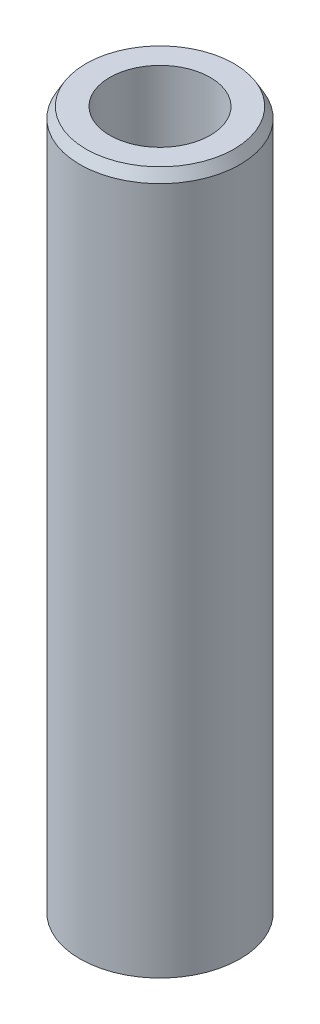
ISO-10303-21;
HEADER;
FILE_DESCRIPTION(('STEP AP214'),'2;1');
FILE_NAME('part.step','',(''),(''),'','','');
FILE_SCHEMA(('AUTOMOTIVE_DESIGN { 1 0 10303 214 1 1 1 1 }'));
ENDSEC;
DATA;
#1=APPLICATION_CONTEXT('core data for automotive mechanical design processes');
#2=APPLICATION_PROTOCOL_DEFINITION('international standard','automotive_design',2000,#1);
#3=PRODUCT_CONTEXT('',#1,'mechanical');
#4=PRODUCT('Part','Part','',(#3));
#5=PRODUCT_RELATED_PRODUCT_CATEGORY('part','',(#4));
#6=PRODUCT_DEFINITION_FORMATION('','',#4);
#7=PRODUCT_DEFINITION_CONTEXT('part definition',#1,'design');
#8=PRODUCT_DEFINITION('design','',#6,#7);
#9=PRODUCT_DEFINITION_SHAPE('','',#8);
#10=(LENGTH_UNIT() NAMED_UNIT(*) SI_UNIT(.MILLI.,.METRE.));
#11=(NAMED_UNIT(*) PLANE_ANGLE_UNIT() SI_UNIT($,.RADIAN.));
#12=(NAMED_UNIT(*) SI_UNIT($,.STERADIAN.) SOLID_ANGLE_UNIT());
#13=UNCERTAINTY_MEASURE_WITH_UNIT(LENGTH_MEASURE(1.E-05),#10,'distance_accuracy_value','');
#14=(GEOMETRIC_REPRESENTATION_CONTEXT(3) GLOBAL_UNCERTAINTY_ASSIGNED_CONTEXT((#13)) GLOBAL_UNIT_ASSIGNED_CONTEXT((#10,
#11,#12)) REPRESENTATION_CONTEXT('',''));
#15=CARTESIAN_POINT('',(0.,0.,0.));
#16=DIRECTION('',(0.,0.,1.));
#17=DIRECTION('',(1.,0.,0.));
#18=AXIS2_PLACEMENT_3D('',#15,#16,#17);
#19=CARTESIAN_POINT('',(0.,65.9908509891248,0.));
#20=DIRECTION('',(0.,-1.,0.));
#21=DIRECTION('',(0.,0.,-1.));
#22=AXIS2_PLACEMENT_3D('',#19,#20,#21);
#23=CYLINDRICAL_SURFACE('',#22,7.5);
#24=CARTESIAN_POINT('',(0.,65.0168997449769,0.));
#25=DIRECTION('',(0.,1.,0.));
#26=DIRECTION('',(0.,0.,1.));
#27=AXIS2_PLACEMENT_3D('',#24,#25,#26);
#28=CIRCLE('',#27,7.5);
#29=CARTESIAN_POINT('',(0.,65.0168997449768,-7.5));
#30=VERTEX_POINT('',#29);
#31=EDGE_CURVE('E50',#30,#30,#28,.F.);
#32=CARTESIAN_POINT('',(0.,0.562311012986413,0.));
#33=DIRECTION('',(0.,1.,0.));
#34=DIRECTION('',(0.,0.,1.));
#35=AXIS2_PLACEMENT_3D('',#32,#33,#34);
#36=CIRCLE('',#35,7.5);
#37=CARTESIAN_POINT('',(0.,0.562311012986413,-7.5));
#38=VERTEX_POINT('',#37);
#39=EDGE_CURVE('E51',#38,#38,#36,.T.);
#40=CARTESIAN_POINT('',(0.,65.0168997449768,-7.5));
#41=CARTESIAN_POINT('',(0.,64.3454977790186,-7.5));
#42=CARTESIAN_POINT('',(0.,63.6740958130604,-7.5));
#43=CARTESIAN_POINT('',(0.,62.3312918811439,-7.5));
#44=CARTESIAN_POINT('',(0.,61.6598899151857,-7.5));
#45=CARTESIAN_POINT('',(0.,60.3170859832692,-7.5));
#46=CARTESIAN_POINT('',(0.,59.645684017311,-7.5));
#47=CARTESIAN_POINT('',(0.,58.3028800853945,-7.5));
#48=CARTESIAN_POINT('',(0.,57.6314781194363,-7.5));
#49=CARTESIAN_POINT('',(0.,56.2886741875198,-7.5));
#50=CARTESIAN_POINT('',(0.,55.6172722215616,-7.5));
#51=CARTESIAN_POINT('',(0.,54.2744682896451,-7.5));
#52=CARTESIAN_POINT('',(0.,53.6030663236869,-7.5));
#53=CARTESIAN_POINT('',(0.,52.2602623917704,-7.5));
#54=CARTESIAN_POINT('',(0.,51.5888604258122,-7.5));
#55=CARTESIAN_POINT('',(0.,50.2460564938957,-7.5));
#56=CARTESIAN_POINT('',(0.,49.5746545279375,-7.5));
#57=CARTESIAN_POINT('',(0.,48.231850596021,-7.5));
#58=CARTESIAN_POINT('',(0.,47.5604486300628,-7.5));
#59=CARTESIAN_POINT('',(0.,46.2176446981463,-7.5));
#60=CARTESIAN_POINT('',(0.,45.5462427321881,-7.5));
#61=CARTESIAN_POINT('',(0.,44.2034388002716,-7.5));
#62=CARTESIAN_POINT('',(0.,43.5320368343134,-7.5));
#63=CARTESIAN_POINT('',(0.,42.1892329023969,-7.5));
#64=CARTESIAN_POINT('',(0.,41.5178309364387,-7.5));
#65=CARTESIAN_POINT('',(0.,40.1750270045222,-7.5));
#66=CARTESIAN_POINT('',(0.,39.503625038564,-7.5));
#67=CARTESIAN_POINT('',(0.,38.1608211066475,-7.5));
#68=CARTESIAN_POINT('',(0.,37.4894191406893,-7.5));
#69=CARTESIAN_POINT('',(0.,36.1466152087728,-7.5));
#70=CARTESIAN_POINT('',(0.,35.4752132428146,-7.5));
#71=CARTESIAN_POINT('',(0.,34.1324093108981,-7.5));
#72=CARTESIAN_POINT('',(0.,33.4610073449399,-7.5));
#73=CARTESIAN_POINT('',(0.,32.1182034130234,-7.5));
#74=CARTESIAN_POINT('',(0.,31.4468014470652,-7.5));
#75=CARTESIAN_POINT('',(0.,30.1039975151487,-7.5));
#76=CARTESIAN_POINT('',(0.,29.4325955491905,-7.5));
#77=CARTESIAN_POINT('',(0.,28.089791617274,-7.5));
#78=CARTESIAN_POINT('',(0.,27.4183896513158,-7.5));
#79=CARTESIAN_POINT('',(0.,26.0755857193993,-7.5));
#80=CARTESIAN_POINT('',(0.,25.4041837534411,-7.5));
#81=CARTESIAN_POINT('',(0.,24.0613798215246,-7.5));
#82=CARTESIAN_POINT('',(0.,23.3899778555664,-7.5));
#83=CARTESIAN_POINT('',(0.,22.0471739236499,-7.5));
#84=CARTESIAN_POINT('',(0.,21.3757719576917,-7.5));
#85=CARTESIAN_POINT('',(0.,20.0329680257752,-7.5));
#86=CARTESIAN_POINT('',(0.,19.361566059817,-7.5));
#87=CARTESIAN_POINT('',(0.,18.0187621279005,-7.5));
#88=CARTESIAN_POINT('',(0.,17.3473601619423,-7.5));
#89=CARTESIAN_POINT('',(0.,16.0045562300258,-7.5));
#90=CARTESIAN_POINT('',(0.,15.3331542640676,-7.5));
#91=CARTESIAN_POINT('',(0.,13.9903503321511,-7.5));
#92=CARTESIAN_POINT('',(0.,13.3189483661929,-7.5));
#93=CARTESIAN_POINT('',(0.,11.9761444342764,-7.5));
#94=CARTESIAN_POINT('',(0.,11.3047424683181,-7.5));
#95=CARTESIAN_POINT('',(0.,9.96193853640168,-7.5));
#96=CARTESIAN_POINT('',(0.,9.29053657044345,-7.5));
#97=CARTESIAN_POINT('',(0.,7.94773263852699,-7.5));
#98=CARTESIAN_POINT('',(0.,7.27633067256875,-7.5));
#99=CARTESIAN_POINT('',(0.,5.93352674065228,-7.5));
#100=CARTESIAN_POINT('',(0.,5.26212477469405,-7.5));
#101=CARTESIAN_POINT('',(0.,3.91932084277758,-7.5));
#102=CARTESIAN_POINT('',(0.,3.24791887681935,-7.5));
#103=CARTESIAN_POINT('',(0.,1.90511494490289,-7.5));
#104=CARTESIAN_POINT('',(0.,1.23371297894465,-7.5));
#105=CARTESIAN_POINT('',(0.,0.562311012986413,-7.5));
#106=B_SPLINE_CURVE_WITH_KNOTS('',3,(#40,#41,#42,#43,#44,#45,#46,#47,#48,#49,#50,#51,#52,#53,
#54,#55,#56,#57,#58,#59,#60,#61,#62,#63,#64,#65,#66,#67,#68,#69,#70,#71,#72,#73,#74,#75,#76,#77,
#78,#79,#80,#81,#82,#83,#84,#85,#86,#87,#88,#89,#90,#91,#92,#93,#94,#95,#96,#97,#98,#99,#100,
#101,#102,#103,#104,#105),.UNSPECIFIED.,.F.,.F.,(4,2,2,2,2,2,2,2,2,2,2,2,2,2,2,2,2,2,2,2,2,2,2,
2,2,2,2,2,2,2,2,2,4),(0.,2.0142058978747,4.02841179574939,6.0426176936241,8.0568235914988,
10.0710294893735,12.0852353872482,14.0994412851229,16.1136471829976,18.1278530808723,
20.142058978747,22.1562648766217,24.1704707744964,26.1846766723711,28.1988825702458,
30.2130884681205,32.2272943659952,34.2415002638699,36.2557061617446,38.2699120596193,
40.284117957494,42.2983238553687,44.3125297532434,46.3267356511181,48.3409415489928,
50.3551474468675,52.3693533447422,54.3835592426169,56.3977651404916,58.4119710383663,
60.426176936241,62.4403828341157,64.4545887319904),.UNSPECIFIED.);
#107=EDGE_CURVE('BSEAM39',#30,#38,#106,.T.);
#108=ORIENTED_EDGE('',*,*,#31,.T.);
#109=ORIENTED_EDGE('',*,*,#39,.T.);
#110=ORIENTED_EDGE('',*,*,#107,.T.);
#111=ORIENTED_EDGE('',*,*,#107,.F.);
#112=EDGE_LOOP('',(#108,#110,#109,#111));
#113=FACE_BOUND('',#112,.T.);
#114=ADVANCED_FACE('F39',(#113),#23,.T.);
#115=CARTESIAN_POINT('',(0.,65.9908509891248,0.));
#116=DIRECTION('',(0.,1.,0.));
#117=DIRECTION('',(0.,0.,1.));
#118=AXIS2_PLACEMENT_3D('',#115,#116,#117);
#119=PLANE('',#118);
#120=CARTESIAN_POINT('',(0.,65.9908509891248,0.));
#121=DIRECTION('',(0.,1.,0.));
#122=DIRECTION('',(0.,0.,1.));
#123=AXIS2_PLACEMENT_3D('',#120,#121,#122);
#124=CIRCLE('',#123,6.93768898701364);
#125=CARTESIAN_POINT('',(0.,65.9908509891248,6.93768898701364));
#126=VERTEX_POINT('',#125);
#127=EDGE_CURVE('E54',#126,#126,#124,.T.);
#128=ORIENTED_EDGE('',*,*,#127,.T.);
#129=EDGE_LOOP('',(#128));
#130=FACE_BOUND('',#129,.T.);
#131=CARTESIAN_POINT('',(0.,65.9908509891248,0.));
#132=DIRECTION('',(0.,1.,0.));
#133=DIRECTION('',(0.,0.,1.));
#134=AXIS2_PLACEMENT_3D('',#131,#132,#133);
#135=CIRCLE('',#134,4.7059466608016);
#136=CARTESIAN_POINT('',(0.,65.9908509891248,-4.7059466608016));
#137=VERTEX_POINT('',#136);
#138=EDGE_CURVE('E58',#137,#137,#135,.T.);
#139=ORIENTED_EDGE('',*,*,#138,.F.);
#140=EDGE_LOOP('',(#139));
#141=FACE_BOUND('',#140,.T.);
#142=ADVANCED_FACE('F69',(#130,#141),#119,.T.);
#143=CARTESIAN_POINT('',(0.,0.,0.));
#144=DIRECTION('',(0.,1.,0.));
#145=DIRECTION('',(0.,0.,1.));
#146=AXIS2_PLACEMENT_3D('',#143,#144,#145);
#147=PLANE('',#146);
#148=CARTESIAN_POINT('',(0.,0.,0.));
#149=DIRECTION('',(0.,1.,0.));
#150=DIRECTION('',(0.,0.,1.));
#151=AXIS2_PLACEMENT_3D('',#148,#149,#150);
#152=CIRCLE('',#151,6.526048755852);
#153=CARTESIAN_POINT('',(0.,0.,6.526048755852));
#154=VERTEX_POINT('',#153);
#155=EDGE_CURVE('E10',#154,#154,#152,.F.);
#156=ORIENTED_EDGE('',*,*,#155,.T.);
#157=EDGE_LOOP('',(#156));
#158=FACE_BOUND('',#157,.T.);
#159=CARTESIAN_POINT('',(0.,0.,0.));
#160=DIRECTION('',(0.,1.,0.));
#161=DIRECTION('',(0.,0.,1.));
#162=AXIS2_PLACEMENT_3D('',#159,#160,#161);
#163=CIRCLE('',#162,4.7059466608016);
#164=CARTESIAN_POINT('',(0.,0.,-4.7059466608016));
#165=VERTEX_POINT('',#164);
#166=EDGE_CURVE('E63',#165,#165,#163,.T.);
#167=ORIENTED_EDGE('',*,*,#166,.T.);
#168=EDGE_LOOP('',(#167));
#169=FACE_BOUND('',#168,.T.);
#170=ADVANCED_FACE('F75',(#158,#169),#147,.F.);
#171=CARTESIAN_POINT('',(0.,65.9908509891248,0.));
#172=DIRECTION('',(0.,-1.,0.));
#173=DIRECTION('',(0.,0.,-1.));
#174=AXIS2_PLACEMENT_3D('',#171,#172,#173);
#175=CYLINDRICAL_SURFACE('',#174,4.7059466608016);
#176=CARTESIAN_POINT('',(0.,65.9908509891248,-4.7059466608016));
#177=CARTESIAN_POINT('',(0.,65.3034462913214,-4.7059466608016));
#178=CARTESIAN_POINT('',(0.,64.616041593518,-4.7059466608016));
#179=CARTESIAN_POINT('',(0.,63.2412321979112,-4.7059466608016));
#180=CARTESIAN_POINT('',(0.,62.5538275001079,-4.7059466608016));
#181=CARTESIAN_POINT('',(0.,61.1790181045011,-4.7059466608016));
#182=CARTESIAN_POINT('',(0.,60.4916134066977,-4.7059466608016));
#183=CARTESIAN_POINT('',(0.,59.1168040110909,-4.7059466608016));
#184=CARTESIAN_POINT('',(0.,58.4293993132875,-4.7059466608016));
#185=CARTESIAN_POINT('',(0.,57.0545899176808,-4.7059466608016));
#186=CARTESIAN_POINT('',(0.,56.3671852198774,-4.7059466608016));
#187=CARTESIAN_POINT('',(0.,54.9923758242706,-4.7059466608016));
#188=CARTESIAN_POINT('',(0.,54.3049711264673,-4.7059466608016));
#189=CARTESIAN_POINT('',(0.,52.9301617308605,-4.7059466608016));
#190=CARTESIAN_POINT('',(0.,52.2427570330571,-4.7059466608016));
#191=CARTESIAN_POINT('',(0.,50.8679476374503,-4.7059466608016));
#192=CARTESIAN_POINT('',(0.,50.180542939647,-4.7059466608016));
#193=CARTESIAN_POINT('',(0.,48.8057335440402,-4.7059466608016));
#194=CARTESIAN_POINT('',(0.,48.1183288462368,-4.7059466608016));
#195=CARTESIAN_POINT('',(0.,46.74351945063,-4.7059466608016));
#196=CARTESIAN_POINT('',(0.,46.0561147528267,-4.7059466608016));
#197=CARTESIAN_POINT('',(0.,44.6813053572199,-4.7059466608016));
#198=CARTESIAN_POINT('',(0.,43.9939006594165,-4.7059466608016));
#199=CARTESIAN_POINT('',(0.,42.6190912638097,-4.7059466608016));
#200=CARTESIAN_POINT('',(0.,41.9316865660064,-4.7059466608016));
#201=CARTESIAN_POINT('',(0.,40.5568771703996,-4.7059466608016));
#202=CARTESIAN_POINT('',(0.,39.8694724725962,-4.7059466608016));
#203=CARTESIAN_POINT('',(0.,38.4946630769894,-4.7059466608016));
#204=CARTESIAN_POINT('',(0.,37.8072583791861,-4.7059466608016));
#205=CARTESIAN_POINT('',(0.,36.4324489835793,-4.7059466608016));
#206=CARTESIAN_POINT('',(0.,35.7450442857759,-4.7059466608016));
#207=CARTESIAN_POINT('',(0.,34.3702348901691,-4.7059466608016));
#208=CARTESIAN_POINT('',(0.,33.6828301923658,-4.7059466608016));
#209=CARTESIAN_POINT('',(0.,32.308020796759,-4.7059466608016));
#210=CARTESIAN_POINT('',(0.,31.6206160989556,-4.7059466608016));
#211=CARTESIAN_POINT('',(0.,30.2458067033488,-4.7059466608016));
#212=CARTESIAN_POINT('',(0.,29.5584020055455,-4.7059466608016));
#213=CARTESIAN_POINT('',(0.,28.1835926099387,-4.7059466608016));
#214=CARTESIAN_POINT('',(0.,27.4961879121353,-4.7059466608016));
#215=CARTESIAN_POINT('',(0.,26.1213785165285,-4.7059466608016));
#216=CARTESIAN_POINT('',(0.,25.4339738187252,-4.7059466608016));
#217=CARTESIAN_POINT('',(0.,24.0591644231184,-4.7059466608016));
#218=CARTESIAN_POINT('',(0.,23.371759725315,-4.7059466608016));
#219=CARTESIAN_POINT('',(0.,21.9969503297082,-4.7059466608016));
#220=CARTESIAN_POINT('',(0.,21.3095456319049,-4.7059466608016));
#221=CARTESIAN_POINT('',(0.,19.9347362362981,-4.7059466608016));
#222=CARTESIAN_POINT('',(0.,19.2473315384947,-4.7059466608016));
#223=CARTESIAN_POINT('',(0.,17.8725221428879,-4.7059466608016));
#224=CARTESIAN_POINT('',(0.,17.1851174450846,-4.7059466608016));
#225=CARTESIAN_POINT('',(0.,15.8103080494778,-4.7059466608016));
#226=CARTESIAN_POINT('',(0.,15.1229033516744,-4.7059466608016));
#227=CARTESIAN_POINT('',(0.,13.7480939560676,-4.7059466608016));
#228=CARTESIAN_POINT('',(0.,13.0606892582643,-4.7059466608016));
#229=CARTESIAN_POINT('',(0.,11.6858798626575,-4.7059466608016));
#230=CARTESIAN_POINT('',(0.,10.9984751648541,-4.7059466608016));
#231=CARTESIAN_POINT('',(0.,9.62366576924735,-4.7059466608016));
#232=CARTESIAN_POINT('',(0.,8.93626107144397,-4.7059466608016));
#233=CARTESIAN_POINT('',(0.,7.5614516758372,-4.7059466608016));
#234=CARTESIAN_POINT('',(0.,6.87404697803382,-4.7059466608016));
#235=CARTESIAN_POINT('',(0.,5.49923758242705,-4.7059466608016));
#236=CARTESIAN_POINT('',(0.,4.81183288462367,-4.7059466608016));
#237=CARTESIAN_POINT('',(0.,3.4370234890169,-4.7059466608016));
#238=CARTESIAN_POINT('',(0.,2.74961879121352,-4.7059466608016));
#239=CARTESIAN_POINT('',(0.,1.37480939560675,-4.7059466608016));
#240=CARTESIAN_POINT('',(0.,0.687404697803367,-4.7059466608016));
#241=CARTESIAN_POINT('',(0.,0.,-4.7059466608016));
#242=B_SPLINE_CURVE_WITH_KNOTS('',3,(#176,#177,#178,#179,#180,#181,#182,#183,#184,#185,#186,
#187,#188,#189,#190,#191,#192,#193,#194,#195,#196,#197,#198,#199,#200,#201,#202,#203,#204,#205,
#206,#207,#208,#209,#210,#211,#212,#213,#214,#215,#216,#217,#218,#219,#220,#221,#222,#223,#224,
#225,#226,#227,#228,#229,#230,#231,#232,#233,#234,#235,#236,#237,#238,#239,#240,#241),
.UNSPECIFIED.,.F.,.F.,(4,2,2,2,2,2,2,2,2,2,2,2,2,2,2,2,2,2,2,2,2,2,2,2,2,2,2,2,2,2,2,2,4),(0.,
2.06221409341015,4.12442818682029,6.18664228023044,8.24885637364059,10.3110704670507,
12.3732845604609,14.435498653871,16.4977127472812,18.5599268406913,20.6221409341015,
22.6843550275116,24.7465691209218,26.8087832143319,28.8709973077421,30.9332114011522,
32.9954254945624,35.0576395879725,37.1198536813827,39.1820677747928,41.244281868203,
43.3064959616131,45.3687100550233,47.4309241484334,49.4931382418436,51.5553523352537,
53.6175664286639,55.679780522074,57.7419946154842,59.8042087088943,61.8664228023045,
63.9286368957146,65.9908509891248),.UNSPECIFIED.);
#243=EDGE_CURVE('BSEAM70',#137,#165,#242,.T.);
#244=ORIENTED_EDGE('',*,*,#138,.T.);
#245=ORIENTED_EDGE('',*,*,#166,.F.);
#246=ORIENTED_EDGE('',*,*,#243,.T.);
#247=ORIENTED_EDGE('',*,*,#243,.F.);
#248=EDGE_LOOP('',(#244,#246,#245,#247));
#249=FACE_BOUND('',#248,.T.);
#250=ADVANCED_FACE('F70',(#249),#175,.F.);
#251=CARTESIAN_POINT('',(0.,65.9908509891248,0.));
#252=DIRECTION('',(0.,-1.,0.));
#253=DIRECTION('',(0.,0.,-1.));
#254=AXIS2_PLACEMENT_3D('',#251,#252,#253);
#255=CONICAL_SURFACE('',#254,6.93768898701364,0.523598775598286);
#256=ORIENTED_EDGE('',*,*,#31,.F.);
#257=EDGE_LOOP('',(#256));
#258=FACE_BOUND('',#257,.T.);
#259=ORIENTED_EDGE('',*,*,#127,.F.);
#260=EDGE_LOOP('',(#259));
#261=FACE_BOUND('',#260,.T.);
#262=ADVANCED_FACE('F81',(#258,#261),#255,.T.);
#263=CARTESIAN_POINT('',(0.,0.562311012986413,0.));
#264=DIRECTION('',(0.,1.,0.));
#265=DIRECTION('',(0.,0.,1.));
#266=AXIS2_PLACEMENT_3D('',#263,#264,#265);
#267=CONICAL_SURFACE('',#266,7.5,1.0471975511966);
#268=ORIENTED_EDGE('',*,*,#155,.F.);
#269=EDGE_LOOP('',(#268));
#270=FACE_BOUND('',#269,.T.);
#271=ORIENTED_EDGE('',*,*,#39,.F.);
#272=EDGE_LOOP('',(#271));
#273=FACE_BOUND('',#272,.T.);
#274=ADVANCED_FACE('F45',(#270,#273),#267,.T.);
#275=CLOSED_SHELL('',(#114,#142,#170,#250,#262,#274));
#276=MANIFOLD_SOLID_BREP('B2',#275);
#277=ADVANCED_BREP_SHAPE_REPRESENTATION('',(#18,#276),#14);
#278=SHAPE_DEFINITION_REPRESENTATION(#9,#277);
ENDSEC;
END-ISO-10303-21;
